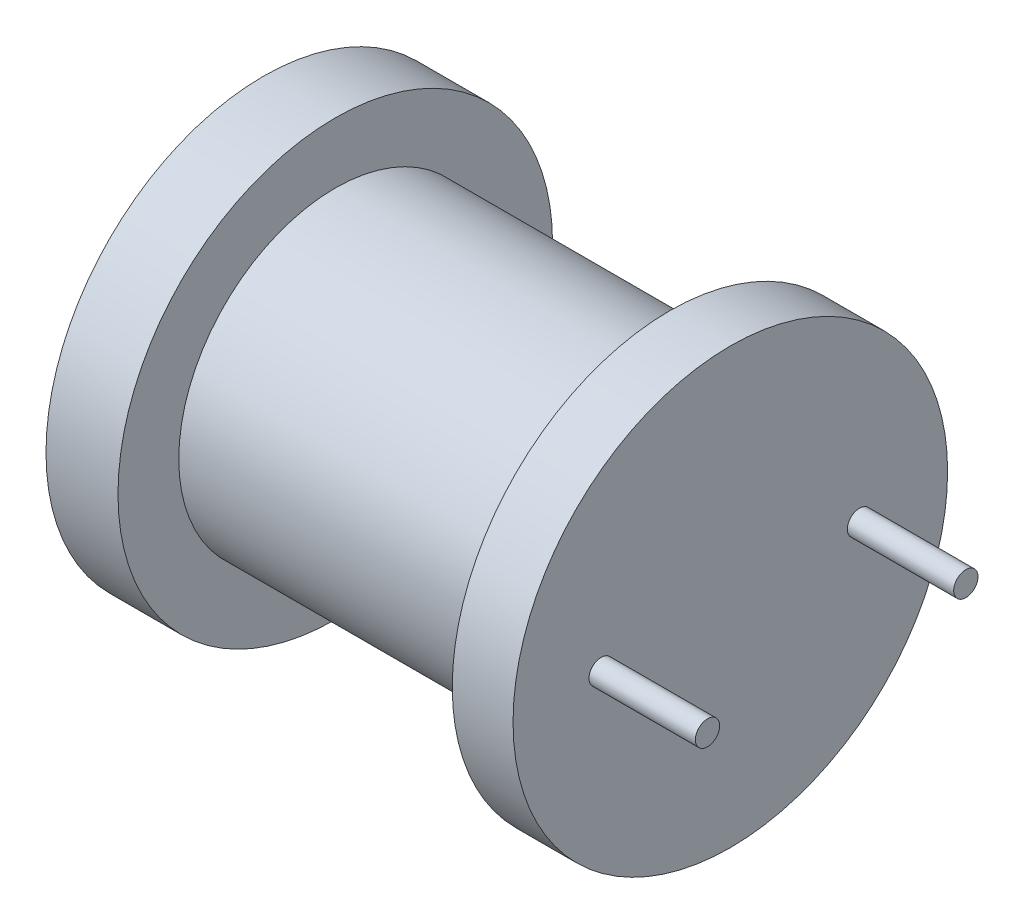
ISO-10303-21;
HEADER;
FILE_DESCRIPTION(('STEP AP214'),'2;1');
FILE_NAME('part.step','',(''),(''),'','','');
FILE_SCHEMA(('AUTOMOTIVE_DESIGN { 1 0 10303 214 1 1 1 1 }'));
ENDSEC;
DATA;
#1=APPLICATION_CONTEXT('core data for automotive mechanical design processes');
#2=APPLICATION_PROTOCOL_DEFINITION('international standard','automotive_design',2000,#1);
#3=PRODUCT_CONTEXT('',#1,'mechanical');
#4=PRODUCT('Part','Part','',(#3));
#5=PRODUCT_RELATED_PRODUCT_CATEGORY('part','',(#4));
#6=PRODUCT_DEFINITION_FORMATION('','',#4);
#7=PRODUCT_DEFINITION_CONTEXT('part definition',#1,'design');
#8=PRODUCT_DEFINITION('design','',#6,#7);
#9=PRODUCT_DEFINITION_SHAPE('','',#8);
#10=(LENGTH_UNIT() NAMED_UNIT(*) SI_UNIT(.MILLI.,.METRE.));
#11=(NAMED_UNIT(*) PLANE_ANGLE_UNIT() SI_UNIT($,.RADIAN.));
#12=(NAMED_UNIT(*) SI_UNIT($,.STERADIAN.) SOLID_ANGLE_UNIT());
#13=UNCERTAINTY_MEASURE_WITH_UNIT(LENGTH_MEASURE(1.E-05),#10,'distance_accuracy_value','');
#14=(GEOMETRIC_REPRESENTATION_CONTEXT(3) GLOBAL_UNCERTAINTY_ASSIGNED_CONTEXT((#13)) GLOBAL_UNIT_ASSIGNED_CONTEXT((#10,
#11,#12)) REPRESENTATION_CONTEXT('',''));
#15=CARTESIAN_POINT('',(0.,0.,0.));
#16=DIRECTION('',(0.,0.,1.));
#17=DIRECTION('',(1.,0.,0.));
#18=AXIS2_PLACEMENT_3D('',#15,#16,#17);
#19=CARTESIAN_POINT('',(0.,0.,0.));
#20=DIRECTION('',(1.,0.,0.));
#21=DIRECTION('',(0.,0.,-1.));
#22=AXIS2_PLACEMENT_3D('',#19,#20,#21);
#23=PLANE('',#22);
#24=CARTESIAN_POINT('',(0.,0.,0.));
#25=DIRECTION('',(-1.,0.,0.));
#26=DIRECTION('',(0.,0.,1.));
#27=AXIS2_PLACEMENT_3D('',#24,#25,#26);
#28=CIRCLE('',#27,7.);
#29=CARTESIAN_POINT('',(0.,0.,7.));
#30=VERTEX_POINT('',#29);
#31=EDGE_CURVE('E51',#30,#30,#28,.T.);
#32=ORIENTED_EDGE('',*,*,#31,.T.);
#33=EDGE_LOOP('',(#32));
#34=FACE_BOUND('',#33,.T.);
#35=ADVANCED_FACE('F39',(#34),#23,.F.);
#36=CARTESIAN_POINT('',(0.0313016320970007,0.,0.));
#37=DIRECTION('',(1.,0.,0.));
#38=DIRECTION('',(0.,0.,-1.));
#39=AXIS2_PLACEMENT_3D('',#36,#37,#38);
#40=CONICAL_SURFACE('',#39,7.15,1.36507106469387);
#41=ORIENTED_EDGE('',*,*,#31,.F.);
#42=EDGE_LOOP('',(#41));
#43=FACE_BOUND('',#42,.T.);
#44=CARTESIAN_POINT('',(0.0313016320970007,0.,0.));
#45=DIRECTION('',(-1.,0.,0.));
#46=DIRECTION('',(0.,0.,1.));
#47=AXIS2_PLACEMENT_3D('',#44,#45,#46);
#48=CIRCLE('',#47,7.15);
#49=CARTESIAN_POINT('',(0.0313016320970007,0.,7.15));
#50=VERTEX_POINT('',#49);
#51=EDGE_CURVE('E56',#50,#50,#48,.T.);
#52=ORIENTED_EDGE('',*,*,#51,.T.);
#53=EDGE_LOOP('',(#52));
#54=FACE_BOUND('',#53,.T.);
#55=ADVANCED_FACE('F106',(#43,#54),#40,.T.);
#56=CARTESIAN_POINT('',(-29.5387931034483,0.,0.));
#57=DIRECTION('',(-1.,0.,0.));
#58=DIRECTION('',(0.,0.,1.));
#59=AXIS2_PLACEMENT_3D('',#56,#57,#58);
#60=CYLINDRICAL_SURFACE('',#59,7.15);
#61=ORIENTED_EDGE('',*,*,#51,.F.);
#62=EDGE_LOOP('',(#61));
#63=FACE_BOUND('',#62,.T.);
#64=CARTESIAN_POINT('',(2.4,0.,0.));
#65=DIRECTION('',(-1.,0.,0.));
#66=DIRECTION('',(0.,0.,1.));
#67=AXIS2_PLACEMENT_3D('',#64,#65,#66);
#68=CIRCLE('',#67,7.15);
#69=CARTESIAN_POINT('',(2.4,0.,7.15));
#70=VERTEX_POINT('',#69);
#71=EDGE_CURVE('E62',#70,#70,#68,.T.);
#72=ORIENTED_EDGE('',*,*,#71,.T.);
#73=EDGE_LOOP('',(#72));
#74=FACE_BOUND('',#73,.T.);
#75=ADVANCED_FACE('F111',(#63,#74),#60,.T.);
#76=CARTESIAN_POINT('',(2.4,7.15,0.));
#77=DIRECTION('',(-1.,0.,0.));
#78=DIRECTION('',(0.,0.,1.));
#79=AXIS2_PLACEMENT_3D('',#76,#77,#78);
#80=PLANE('',#79);
#81=ORIENTED_EDGE('',*,*,#71,.F.);
#82=EDGE_LOOP('',(#81));
#83=FACE_BOUND('',#82,.T.);
#84=CARTESIAN_POINT('',(2.4,0.,0.));
#85=DIRECTION('',(-1.,0.,0.));
#86=DIRECTION('',(0.,0.,1.));
#87=AXIS2_PLACEMENT_3D('',#84,#85,#86);
#88=CIRCLE('',#87,5.15);
#89=CARTESIAN_POINT('',(2.4,0.,5.15));
#90=VERTEX_POINT('',#89);
#91=EDGE_CURVE('E66',#90,#90,#88,.T.);
#92=ORIENTED_EDGE('',*,*,#91,.T.);
#93=EDGE_LOOP('',(#92));
#94=FACE_BOUND('',#93,.T.);
#95=ADVANCED_FACE('F119',(#83,#94),#80,.F.);
#96=CARTESIAN_POINT('',(-29.5387931034483,0.,0.));
#97=DIRECTION('',(-1.,0.,0.));
#98=DIRECTION('',(0.,0.,1.));
#99=AXIS2_PLACEMENT_3D('',#96,#97,#98);
#100=CYLINDRICAL_SURFACE('',#99,5.15);
#101=ORIENTED_EDGE('',*,*,#91,.F.);
#102=EDGE_LOOP('',(#101));
#103=FACE_BOUND('',#102,.T.);
#104=CARTESIAN_POINT('',(13.4,0.,0.));
#105=DIRECTION('',(-1.,0.,0.));
#106=DIRECTION('',(0.,0.,1.));
#107=AXIS2_PLACEMENT_3D('',#104,#105,#106);
#108=CIRCLE('',#107,5.15);
#109=CARTESIAN_POINT('',(13.4,0.,5.15));
#110=VERTEX_POINT('',#109);
#111=EDGE_CURVE('E70',#110,#110,#108,.T.);
#112=ORIENTED_EDGE('',*,*,#111,.T.);
#113=EDGE_LOOP('',(#112));
#114=FACE_BOUND('',#113,.T.);
#115=ADVANCED_FACE('F125',(#103,#114),#100,.T.);
#116=CARTESIAN_POINT('',(13.4,5.15,0.));
#117=DIRECTION('',(1.,0.,0.));
#118=DIRECTION('',(0.,0.,-1.));
#119=AXIS2_PLACEMENT_3D('',#116,#117,#118);
#120=PLANE('',#119);
#121=ORIENTED_EDGE('',*,*,#111,.F.);
#122=EDGE_LOOP('',(#121));
#123=FACE_BOUND('',#122,.T.);
#124=CARTESIAN_POINT('',(13.4,0.,0.));
#125=DIRECTION('',(-1.,0.,0.));
#126=DIRECTION('',(0.,0.,1.));
#127=AXIS2_PLACEMENT_3D('',#124,#125,#126);
#128=CIRCLE('',#127,7.15);
#129=CARTESIAN_POINT('',(13.4,0.,7.15));
#130=VERTEX_POINT('',#129);
#131=EDGE_CURVE('E74',#130,#130,#128,.T.);
#132=ORIENTED_EDGE('',*,*,#131,.T.);
#133=EDGE_LOOP('',(#132));
#134=FACE_BOUND('',#133,.T.);
#135=ADVANCED_FACE('F131',(#123,#134),#120,.F.);
#136=CARTESIAN_POINT('',(-29.5387931034483,0.,0.));
#137=DIRECTION('',(-1.,0.,0.));
#138=DIRECTION('',(0.,0.,1.));
#139=AXIS2_PLACEMENT_3D('',#136,#137,#138);
#140=CYLINDRICAL_SURFACE('',#139,7.15);
#141=ORIENTED_EDGE('',*,*,#131,.F.);
#142=EDGE_LOOP('',(#141));
#143=FACE_BOUND('',#142,.T.);
#144=CARTESIAN_POINT('',(15.4,0.,0.));
#145=DIRECTION('',(-1.,0.,0.));
#146=DIRECTION('',(0.,0.,1.));
#147=AXIS2_PLACEMENT_3D('',#144,#145,#146);
#148=CIRCLE('',#147,7.15);
#149=CARTESIAN_POINT('',(15.4,0.,7.15));
#150=VERTEX_POINT('',#149);
#151=EDGE_CURVE('E78',#150,#150,#148,.T.);
#152=ORIENTED_EDGE('',*,*,#151,.T.);
#153=EDGE_LOOP('',(#152));
#154=FACE_BOUND('',#153,.T.);
#155=ADVANCED_FACE('F137',(#143,#154),#140,.T.);
#156=CARTESIAN_POINT('',(15.4,7.15,0.));
#157=DIRECTION('',(-1.,0.,0.));
#158=DIRECTION('',(0.,0.,1.));
#159=AXIS2_PLACEMENT_3D('',#156,#157,#158);
#160=PLANE('',#159);
#161=CARTESIAN_POINT('',(15.4,0.,-4.25));
#162=DIRECTION('',(-1.,0.,0.));
#163=DIRECTION('',(0.,0.,1.));
#164=AXIS2_PLACEMENT_3D('',#161,#162,#163);
#165=CIRCLE('',#164,0.400000000000001);
#166=CARTESIAN_POINT('',(15.4,0.,-3.85));
#167=VERTEX_POINT('',#166);
#168=EDGE_CURVE('E10',#167,#167,#165,.F.);
#169=ORIENTED_EDGE('',*,*,#168,.F.);
#170=EDGE_LOOP('',(#169));
#171=FACE_BOUND('',#170,.T.);
#172=CARTESIAN_POINT('',(15.4,0.,4.25));
#173=DIRECTION('',(-1.,0.,0.));
#174=DIRECTION('',(0.,0.,1.));
#175=AXIS2_PLACEMENT_3D('',#172,#173,#174);
#176=CIRCLE('',#175,0.4);
#177=CARTESIAN_POINT('',(15.4,0.,4.65));
#178=VERTEX_POINT('',#177);
#179=EDGE_CURVE('E46',#178,#178,#176,.F.);
#180=ORIENTED_EDGE('',*,*,#179,.F.);
#181=EDGE_LOOP('',(#180));
#182=FACE_BOUND('',#181,.T.);
#183=ORIENTED_EDGE('',*,*,#151,.F.);
#184=EDGE_LOOP('',(#183));
#185=FACE_BOUND('',#184,.T.);
#186=ADVANCED_FACE('F143',(#171,#182,#185),#160,.F.);
#187=CARTESIAN_POINT('',(18.9,0.,4.25));
#188=DIRECTION('',(-1.,0.,0.));
#189=DIRECTION('',(0.,0.,1.));
#190=AXIS2_PLACEMENT_3D('',#187,#188,#189);
#191=CYLINDRICAL_SURFACE('',#190,0.4);
#192=CARTESIAN_POINT('',(18.9,0.,4.25));
#193=DIRECTION('',(1.,0.,0.));
#194=DIRECTION('',(0.,0.,-1.));
#195=AXIS2_PLACEMENT_3D('',#192,#193,#194);
#196=CIRCLE('',#195,0.4);
#197=CARTESIAN_POINT('',(18.9,0.,3.85));
#198=VERTEX_POINT('',#197);
#199=EDGE_CURVE('E82',#198,#198,#196,.T.);
#200=ORIENTED_EDGE('',*,*,#199,.F.);
#201=EDGE_LOOP('',(#200));
#202=FACE_BOUND('',#201,.T.);
#203=ORIENTED_EDGE('',*,*,#179,.T.);
#204=EDGE_LOOP('',(#203));
#205=FACE_BOUND('',#204,.T.);
#206=ADVANCED_FACE('F102',(#202,#205),#191,.T.);
#207=CARTESIAN_POINT('',(18.9,0.,4.25));
#208=DIRECTION('',(1.,0.,0.));
#209=DIRECTION('',(0.,0.,-1.));
#210=AXIS2_PLACEMENT_3D('',#207,#208,#209);
#211=PLANE('',#210);
#212=ORIENTED_EDGE('',*,*,#199,.T.);
#213=EDGE_LOOP('',(#212));
#214=FACE_BOUND('',#213,.T.);
#215=ADVANCED_FACE('F95',(#214),#211,.T.);
#216=CARTESIAN_POINT('',(18.9,0.,-4.25));
#217=DIRECTION('',(-1.,0.,0.));
#218=DIRECTION('',(0.,0.,1.));
#219=AXIS2_PLACEMENT_3D('',#216,#217,#218);
#220=CYLINDRICAL_SURFACE('',#219,0.400000000000001);
#221=CARTESIAN_POINT('',(18.9,0.,-4.25));
#222=DIRECTION('',(1.,0.,0.));
#223=DIRECTION('',(0.,0.,-1.));
#224=AXIS2_PLACEMENT_3D('',#221,#222,#223);
#225=CIRCLE('',#224,0.400000000000001);
#226=CARTESIAN_POINT('',(18.9,0.,-4.65));
#227=VERTEX_POINT('',#226);
#228=EDGE_CURVE('E86',#227,#227,#225,.T.);
#229=ORIENTED_EDGE('',*,*,#228,.F.);
#230=EDGE_LOOP('',(#229));
#231=FACE_BOUND('',#230,.T.);
#232=ORIENTED_EDGE('',*,*,#168,.T.);
#233=EDGE_LOOP('',(#232));
#234=FACE_BOUND('',#233,.T.);
#235=ADVANCED_FACE('F93',(#231,#234),#220,.T.);
#236=CARTESIAN_POINT('',(18.9,0.,-4.25));
#237=DIRECTION('',(1.,0.,0.));
#238=DIRECTION('',(0.,0.,-1.));
#239=AXIS2_PLACEMENT_3D('',#236,#237,#238);
#240=PLANE('',#239);
#241=ORIENTED_EDGE('',*,*,#228,.T.);
#242=EDGE_LOOP('',(#241));
#243=FACE_BOUND('',#242,.T.);
#244=ADVANCED_FACE('F91',(#243),#240,.T.);
#245=CLOSED_SHELL('',(#35,#55,#75,#95,#115,#135,#155,#186,#206,#215,#235,#244));
#246=MANIFOLD_SOLID_BREP('B2',#245);
#247=ADVANCED_BREP_SHAPE_REPRESENTATION('',(#18,#246),#14);
#248=SHAPE_DEFINITION_REPRESENTATION(#9,#247);
ENDSEC;
END-ISO-10303-21;
